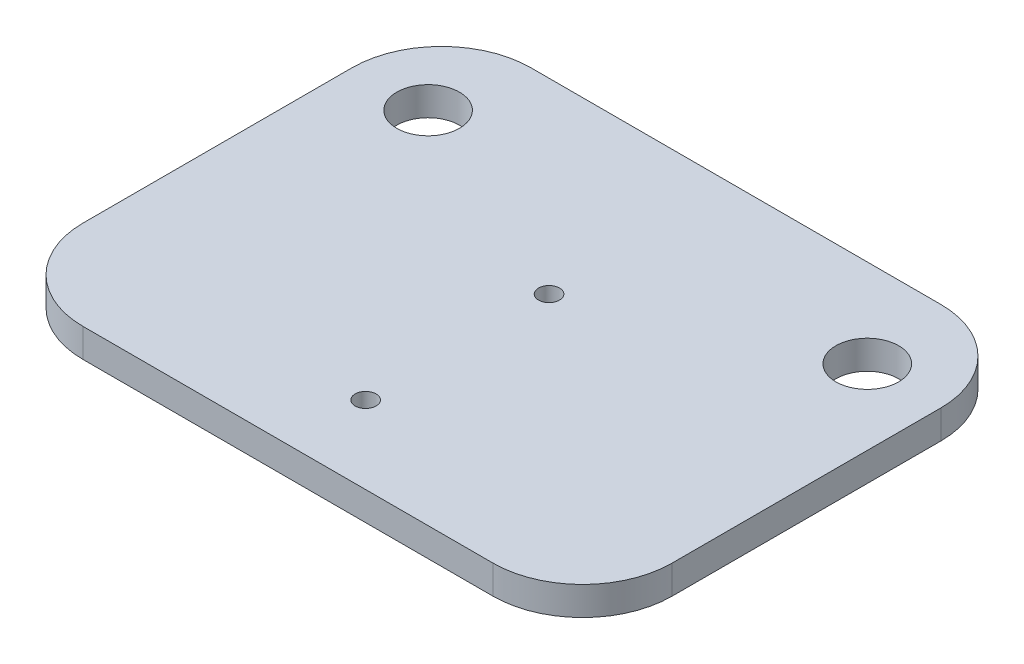
ISO-10303-21;
HEADER;
FILE_DESCRIPTION(('STEP AP214'),'2;1');
FILE_NAME('part.step','',(''),(''),'','','');
FILE_SCHEMA(('AUTOMOTIVE_DESIGN { 1 0 10303 214 1 1 1 1 }'));
ENDSEC;
DATA;
#1=APPLICATION_CONTEXT('core data for automotive mechanical design processes');
#2=APPLICATION_PROTOCOL_DEFINITION('international standard','automotive_design',2000,#1);
#3=PRODUCT_CONTEXT('',#1,'mechanical');
#4=PRODUCT('Part','Part','',(#3));
#5=PRODUCT_RELATED_PRODUCT_CATEGORY('part','',(#4));
#6=PRODUCT_DEFINITION_FORMATION('','',#4);
#7=PRODUCT_DEFINITION_CONTEXT('part definition',#1,'design');
#8=PRODUCT_DEFINITION('design','',#6,#7);
#9=PRODUCT_DEFINITION_SHAPE('','',#8);
#10=(LENGTH_UNIT() NAMED_UNIT(*) SI_UNIT(.MILLI.,.METRE.));
#11=(NAMED_UNIT(*) PLANE_ANGLE_UNIT() SI_UNIT($,.RADIAN.));
#12=(NAMED_UNIT(*) SI_UNIT($,.STERADIAN.) SOLID_ANGLE_UNIT());
#13=UNCERTAINTY_MEASURE_WITH_UNIT(LENGTH_MEASURE(1.E-05),#10,'distance_accuracy_value','');
#14=(GEOMETRIC_REPRESENTATION_CONTEXT(3) GLOBAL_UNCERTAINTY_ASSIGNED_CONTEXT((#13)) GLOBAL_UNIT_ASSIGNED_CONTEXT((#10,
#11,#12)) REPRESENTATION_CONTEXT('',''));
#15=CARTESIAN_POINT('',(0.,0.,0.));
#16=DIRECTION('',(0.,0.,1.));
#17=DIRECTION('',(1.,0.,0.));
#18=AXIS2_PLACEMENT_3D('',#15,#16,#17);
#19=CARTESIAN_POINT('',(-5.81,0.8128,3.81));
#20=DIRECTION('',(0.,-1.,0.));
#21=DIRECTION('',(0.,0.,-1.));
#22=AXIS2_PLACEMENT_3D('',#19,#20,#21);
#23=CYLINDRICAL_SURFACE('',#22,2.54);
#24=CARTESIAN_POINT('',(-5.81,0.,3.81));
#25=DIRECTION('',(0.,1.,0.));
#26=DIRECTION('',(0.,0.,1.));
#27=AXIS2_PLACEMENT_3D('',#24,#25,#26);
#28=CIRCLE('',#27,2.54);
#29=CARTESIAN_POINT('',(-8.35,0.,3.80999999999998));
#30=VERTEX_POINT('',#29);
#31=CARTESIAN_POINT('',(-5.80999999999998,0.,6.35));
#32=VERTEX_POINT('',#31);
#33=EDGE_CURVE('E133',#30,#32,#28,.T.);
#34=ORIENTED_EDGE('',*,*,#33,.T.);
#35=DIRECTION('',(0.,-1.,0.));
#36=VECTOR('',#35,1.);
#37=CARTESIAN_POINT('',(-5.80999999999998,0.8128,6.35));
#38=LINE('',#37,#36);
#39=CARTESIAN_POINT('',(-5.80999999999998,0.8128,6.35));
#40=VERTEX_POINT('',#39);
#41=EDGE_CURVE('E11',#40,#32,#38,.T.);
#42=ORIENTED_EDGE('',*,*,#41,.F.);
#43=CARTESIAN_POINT('',(-5.81,0.8128,3.81));
#44=DIRECTION('',(0.,1.,0.));
#45=DIRECTION('',(0.,0.,1.));
#46=AXIS2_PLACEMENT_3D('',#43,#44,#45);
#47=CIRCLE('',#46,2.54);
#48=CARTESIAN_POINT('',(-8.35,0.8128,3.80999999999998));
#49=VERTEX_POINT('',#48);
#50=EDGE_CURVE('E148',#49,#40,#47,.T.);
#51=ORIENTED_EDGE('',*,*,#50,.F.);
#52=DIRECTION('',(0.,-1.,0.));
#53=VECTOR('',#52,1.);
#54=CARTESIAN_POINT('',(-8.35,0.8128,3.80999999999998));
#55=LINE('',#54,#53);
#56=EDGE_CURVE('E129',#49,#30,#55,.T.);
#57=ORIENTED_EDGE('',*,*,#56,.T.);
#58=EDGE_LOOP('',(#34,#42,#51,#57));
#59=FACE_BOUND('',#58,.T.);
#60=ADVANCED_FACE('F35',(#59),#23,.T.);
#61=CARTESIAN_POINT('',(-5.80999999999998,0.8128,6.35));
#62=DIRECTION('',(0.,0.,-1.));
#63=DIRECTION('',(-1.,0.,0.));
#64=AXIS2_PLACEMENT_3D('',#61,#62,#63);
#65=PLANE('',#64);
#66=DIRECTION('',(1.,0.,0.));
#67=VECTOR('',#66,1.);
#68=CARTESIAN_POINT('',(-5.80999999999998,0.,6.35));
#69=LINE('',#68,#67);
#70=CARTESIAN_POINT('',(5.80999999999998,0.,6.35));
#71=VERTEX_POINT('',#70);
#72=EDGE_CURVE('E136',#32,#71,#69,.T.);
#73=ORIENTED_EDGE('',*,*,#72,.T.);
#74=DIRECTION('',(0.,-1.,0.));
#75=VECTOR('',#74,1.);
#76=CARTESIAN_POINT('',(5.80999999999998,0.8128,6.35));
#77=LINE('',#76,#75);
#78=CARTESIAN_POINT('',(5.80999999999998,0.8128,6.35));
#79=VERTEX_POINT('',#78);
#80=EDGE_CURVE('E44',#79,#71,#77,.T.);
#81=ORIENTED_EDGE('',*,*,#80,.F.);
#82=DIRECTION('',(1.,0.,0.));
#83=VECTOR('',#82,1.);
#84=CARTESIAN_POINT('',(-5.80999999999998,0.8128,6.35));
#85=LINE('',#84,#83);
#86=EDGE_CURVE('E96',#40,#79,#85,.T.);
#87=ORIENTED_EDGE('',*,*,#86,.F.);
#88=ORIENTED_EDGE('',*,*,#41,.T.);
#89=EDGE_LOOP('',(#73,#81,#87,#88));
#90=FACE_BOUND('',#89,.T.);
#91=ADVANCED_FACE('F216',(#90),#65,.F.);
#92=CARTESIAN_POINT('',(5.81,0.8128,3.81));
#93=DIRECTION('',(0.,-1.,0.));
#94=DIRECTION('',(0.,0.,-1.));
#95=AXIS2_PLACEMENT_3D('',#92,#93,#94);
#96=CYLINDRICAL_SURFACE('',#95,2.54);
#97=CARTESIAN_POINT('',(5.81,0.,3.81));
#98=DIRECTION('',(0.,1.,0.));
#99=DIRECTION('',(0.,0.,1.));
#100=AXIS2_PLACEMENT_3D('',#97,#98,#99);
#101=CIRCLE('',#100,2.54);
#102=CARTESIAN_POINT('',(8.35,0.,3.80999999999998));
#103=VERTEX_POINT('',#102);
#104=EDGE_CURVE('E139',#71,#103,#101,.T.);
#105=ORIENTED_EDGE('',*,*,#104,.T.);
#106=DIRECTION('',(0.,-1.,0.));
#107=VECTOR('',#106,1.);
#108=CARTESIAN_POINT('',(8.35,0.8128,3.80999999999998));
#109=LINE('',#108,#107);
#110=CARTESIAN_POINT('',(8.35,0.8128,3.80999999999998));
#111=VERTEX_POINT('',#110);
#112=EDGE_CURVE('E155',#111,#103,#109,.T.);
#113=ORIENTED_EDGE('',*,*,#112,.F.);
#114=CARTESIAN_POINT('',(5.81,0.8128,3.81));
#115=DIRECTION('',(0.,1.,0.));
#116=DIRECTION('',(0.,0.,1.));
#117=AXIS2_PLACEMENT_3D('',#114,#115,#116);
#118=CIRCLE('',#117,2.54);
#119=EDGE_CURVE('E184',#79,#111,#118,.T.);
#120=ORIENTED_EDGE('',*,*,#119,.F.);
#121=ORIENTED_EDGE('',*,*,#80,.T.);
#122=EDGE_LOOP('',(#105,#113,#120,#121));
#123=FACE_BOUND('',#122,.T.);
#124=ADVANCED_FACE('F220',(#123),#96,.T.);
#125=CARTESIAN_POINT('',(8.35,0.8128,3.80999999999998));
#126=DIRECTION('',(-1.,0.,0.));
#127=DIRECTION('',(0.,0.,1.));
#128=AXIS2_PLACEMENT_3D('',#125,#126,#127);
#129=PLANE('',#128);
#130=DIRECTION('',(0.,0.,-1.));
#131=VECTOR('',#130,1.);
#132=CARTESIAN_POINT('',(8.35,0.,3.80999999999998));
#133=LINE('',#132,#131);
#134=CARTESIAN_POINT('',(8.35,0.,-3.80999999999998));
#135=VERTEX_POINT('',#134);
#136=EDGE_CURVE('E141',#103,#135,#133,.T.);
#137=ORIENTED_EDGE('',*,*,#136,.T.);
#138=DIRECTION('',(0.,-1.,0.));
#139=VECTOR('',#138,1.);
#140=CARTESIAN_POINT('',(8.35,0.8128,-3.80999999999998));
#141=LINE('',#140,#139);
#142=CARTESIAN_POINT('',(8.35,0.8128,-3.80999999999998));
#143=VERTEX_POINT('',#142);
#144=EDGE_CURVE('E152',#143,#135,#141,.T.);
#145=ORIENTED_EDGE('',*,*,#144,.F.);
#146=DIRECTION('',(0.,0.,-1.));
#147=VECTOR('',#146,1.);
#148=CARTESIAN_POINT('',(8.35,0.8128,3.80999999999998));
#149=LINE('',#148,#147);
#150=EDGE_CURVE('E186',#111,#143,#149,.T.);
#151=ORIENTED_EDGE('',*,*,#150,.F.);
#152=ORIENTED_EDGE('',*,*,#112,.T.);
#153=EDGE_LOOP('',(#137,#145,#151,#152));
#154=FACE_BOUND('',#153,.T.);
#155=ADVANCED_FACE('F192',(#154),#129,.F.);
#156=CARTESIAN_POINT('',(5.81,0.8128,-3.81));
#157=DIRECTION('',(0.,-1.,0.));
#158=DIRECTION('',(0.,0.,-1.));
#159=AXIS2_PLACEMENT_3D('',#156,#157,#158);
#160=CYLINDRICAL_SURFACE('',#159,2.54);
#161=CARTESIAN_POINT('',(5.81,0.,-3.81));
#162=DIRECTION('',(0.,1.,0.));
#163=DIRECTION('',(0.,0.,1.));
#164=AXIS2_PLACEMENT_3D('',#161,#162,#163);
#165=CIRCLE('',#164,2.54);
#166=CARTESIAN_POINT('',(5.80999999999998,0.,-6.35));
#167=VERTEX_POINT('',#166);
#168=EDGE_CURVE('E143',#135,#167,#165,.T.);
#169=ORIENTED_EDGE('',*,*,#168,.T.);
#170=DIRECTION('',(0.,-1.,0.));
#171=VECTOR('',#170,1.);
#172=CARTESIAN_POINT('',(5.80999999999998,0.8128,-6.35));
#173=LINE('',#172,#171);
#174=CARTESIAN_POINT('',(5.80999999999998,0.8128,-6.35));
#175=VERTEX_POINT('',#174);
#176=EDGE_CURVE('E124',#175,#167,#173,.T.);
#177=ORIENTED_EDGE('',*,*,#176,.F.);
#178=CARTESIAN_POINT('',(5.81,0.8128,-3.81));
#179=DIRECTION('',(0.,1.,0.));
#180=DIRECTION('',(0.,0.,1.));
#181=AXIS2_PLACEMENT_3D('',#178,#179,#180);
#182=CIRCLE('',#181,2.54);
#183=EDGE_CURVE('E115',#143,#175,#182,.T.);
#184=ORIENTED_EDGE('',*,*,#183,.F.);
#185=ORIENTED_EDGE('',*,*,#144,.T.);
#186=EDGE_LOOP('',(#169,#177,#184,#185));
#187=FACE_BOUND('',#186,.T.);
#188=ADVANCED_FACE('F196',(#187),#160,.T.);
#189=CARTESIAN_POINT('',(-5.80999999999998,0.8128,-6.35));
#190=DIRECTION('',(0.,0.,1.));
#191=DIRECTION('',(1.,0.,0.));
#192=AXIS2_PLACEMENT_3D('',#189,#190,#191);
#193=PLANE('',#192);
#194=DIRECTION('',(-1.,0.,0.));
#195=VECTOR('',#194,1.);
#196=CARTESIAN_POINT('',(-5.80999999999998,0.,-6.35));
#197=LINE('',#196,#195);
#198=CARTESIAN_POINT('',(-5.80999999999998,0.,-6.35));
#199=VERTEX_POINT('',#198);
#200=EDGE_CURVE('E123',#167,#199,#197,.T.);
#201=ORIENTED_EDGE('',*,*,#200,.T.);
#202=DIRECTION('',(0.,-1.,0.));
#203=VECTOR('',#202,1.);
#204=CARTESIAN_POINT('',(-5.80999999999998,0.8128,-6.35));
#205=LINE('',#204,#203);
#206=CARTESIAN_POINT('',(-5.80999999999998,0.8128,-6.35));
#207=VERTEX_POINT('',#206);
#208=EDGE_CURVE('E120',#207,#199,#205,.T.);
#209=ORIENTED_EDGE('',*,*,#208,.F.);
#210=DIRECTION('',(-1.,0.,0.));
#211=VECTOR('',#210,1.);
#212=CARTESIAN_POINT('',(-5.80999999999998,0.8128,-6.35));
#213=LINE('',#212,#211);
#214=EDGE_CURVE('E109',#175,#207,#213,.T.);
#215=ORIENTED_EDGE('',*,*,#214,.F.);
#216=ORIENTED_EDGE('',*,*,#176,.T.);
#217=EDGE_LOOP('',(#201,#209,#215,#216));
#218=FACE_BOUND('',#217,.T.);
#219=ADVANCED_FACE('F121',(#218),#193,.F.);
#220=CARTESIAN_POINT('',(-5.81,0.8128,-3.81));
#221=DIRECTION('',(0.,-1.,0.));
#222=DIRECTION('',(0.,0.,-1.));
#223=AXIS2_PLACEMENT_3D('',#220,#221,#222);
#224=CYLINDRICAL_SURFACE('',#223,2.54);
#225=CARTESIAN_POINT('',(-5.81,0.,-3.81));
#226=DIRECTION('',(0.,1.,0.));
#227=DIRECTION('',(0.,0.,1.));
#228=AXIS2_PLACEMENT_3D('',#225,#226,#227);
#229=CIRCLE('',#228,2.54);
#230=CARTESIAN_POINT('',(-8.35,0.,-3.80999999999998));
#231=VERTEX_POINT('',#230);
#232=EDGE_CURVE('E82',#199,#231,#229,.T.);
#233=ORIENTED_EDGE('',*,*,#232,.T.);
#234=DIRECTION('',(0.,-1.,0.));
#235=VECTOR('',#234,1.);
#236=CARTESIAN_POINT('',(-8.35,0.8128,-3.80999999999998));
#237=LINE('',#236,#235);
#238=CARTESIAN_POINT('',(-8.35,0.8128,-3.80999999999998));
#239=VERTEX_POINT('',#238);
#240=EDGE_CURVE('E125',#239,#231,#237,.T.);
#241=ORIENTED_EDGE('',*,*,#240,.F.);
#242=CARTESIAN_POINT('',(-5.81,0.8128,-3.81));
#243=DIRECTION('',(0.,1.,0.));
#244=DIRECTION('',(0.,0.,1.));
#245=AXIS2_PLACEMENT_3D('',#242,#243,#244);
#246=CIRCLE('',#245,2.54);
#247=EDGE_CURVE('E113',#207,#239,#246,.T.);
#248=ORIENTED_EDGE('',*,*,#247,.F.);
#249=ORIENTED_EDGE('',*,*,#208,.T.);
#250=EDGE_LOOP('',(#233,#241,#248,#249));
#251=FACE_BOUND('',#250,.T.);
#252=ADVANCED_FACE('F127',(#251),#224,.T.);
#253=CARTESIAN_POINT('',(-8.35,0.8128,3.80999999999998));
#254=DIRECTION('',(1.,0.,0.));
#255=DIRECTION('',(0.,0.,-1.));
#256=AXIS2_PLACEMENT_3D('',#253,#254,#255);
#257=PLANE('',#256);
#258=DIRECTION('',(0.,0.,1.));
#259=VECTOR('',#258,1.);
#260=CARTESIAN_POINT('',(-8.35,0.,3.80999999999998));
#261=LINE('',#260,#259);
#262=EDGE_CURVE('E88',#231,#30,#261,.T.);
#263=ORIENTED_EDGE('',*,*,#262,.T.);
#264=ORIENTED_EDGE('',*,*,#56,.F.);
#265=DIRECTION('',(0.,0.,1.));
#266=VECTOR('',#265,1.);
#267=CARTESIAN_POINT('',(-8.35,0.8128,3.80999999999998));
#268=LINE('',#267,#266);
#269=EDGE_CURVE('E53',#239,#49,#268,.T.);
#270=ORIENTED_EDGE('',*,*,#269,.F.);
#271=ORIENTED_EDGE('',*,*,#240,.T.);
#272=EDGE_LOOP('',(#263,#264,#270,#271));
#273=FACE_BOUND('',#272,.T.);
#274=ADVANCED_FACE('F204',(#273),#257,.F.);
#275=CARTESIAN_POINT('',(-5.81,0.8128,3.81));
#276=DIRECTION('',(0.,1.,0.));
#277=DIRECTION('',(0.,0.,1.));
#278=AXIS2_PLACEMENT_3D('',#275,#276,#277);
#279=PLANE('',#278);
#280=CARTESIAN_POINT('',(-6.22836359994347,0.8128,-3.85));
#281=DIRECTION('',(0.,1.,0.));
#282=DIRECTION('',(0.,0.,1.));
#283=AXIS2_PLACEMENT_3D('',#280,#281,#282);
#284=CIRCLE('',#283,0.889);
#285=CARTESIAN_POINT('',(-6.22836359994347,0.8128,-2.961));
#286=VERTEX_POINT('',#285);
#287=EDGE_CURVE('E137',#286,#286,#284,.T.);
#288=ORIENTED_EDGE('',*,*,#287,.F.);
#289=EDGE_LOOP('',(#288));
#290=FACE_BOUND('',#289,.T.);
#291=CARTESIAN_POINT('',(0.,0.8128,-1.05));
#292=DIRECTION('',(0.,1.,0.));
#293=DIRECTION('',(0.,0.,1.));
#294=AXIS2_PLACEMENT_3D('',#291,#292,#293);
#295=CIRCLE('',#294,0.297244980669235);
#296=CARTESIAN_POINT('',(0.,0.8128,-0.752755019330762));
#297=VERTEX_POINT('',#296);
#298=EDGE_CURVE('E169',#297,#297,#295,.T.);
#299=ORIENTED_EDGE('',*,*,#298,.F.);
#300=EDGE_LOOP('',(#299));
#301=FACE_BOUND('',#300,.T.);
#302=CARTESIAN_POINT('',(0.,0.8128,4.15));
#303=DIRECTION('',(0.,1.,0.));
#304=DIRECTION('',(0.,0.,1.));
#305=AXIS2_PLACEMENT_3D('',#302,#303,#304);
#306=CIRCLE('',#305,0.297244980669235);
#307=CARTESIAN_POINT('',(0.,0.8128,4.44724498066924));
#308=VERTEX_POINT('',#307);
#309=EDGE_CURVE('E166',#308,#308,#306,.T.);
#310=ORIENTED_EDGE('',*,*,#309,.F.);
#311=EDGE_LOOP('',(#310));
#312=FACE_BOUND('',#311,.T.);
#313=CARTESIAN_POINT('',(6.223,0.8128,-3.85));
#314=DIRECTION('',(0.,1.,0.));
#315=DIRECTION('',(0.,0.,1.));
#316=AXIS2_PLACEMENT_3D('',#313,#314,#315);
#317=CIRCLE('',#316,0.889);
#318=CARTESIAN_POINT('',(6.223,0.8128,-2.961));
#319=VERTEX_POINT('',#318);
#320=EDGE_CURVE('E163',#319,#319,#317,.T.);
#321=ORIENTED_EDGE('',*,*,#320,.F.);
#322=EDGE_LOOP('',(#321));
#323=FACE_BOUND('',#322,.T.);
#324=ORIENTED_EDGE('',*,*,#50,.T.);
#325=ORIENTED_EDGE('',*,*,#86,.T.);
#326=ORIENTED_EDGE('',*,*,#119,.T.);
#327=ORIENTED_EDGE('',*,*,#150,.T.);
#328=ORIENTED_EDGE('',*,*,#183,.T.);
#329=ORIENTED_EDGE('',*,*,#214,.T.);
#330=ORIENTED_EDGE('',*,*,#247,.T.);
#331=ORIENTED_EDGE('',*,*,#269,.T.);
#332=EDGE_LOOP('',(#324,#325,#326,#327,#328,#329,#330,#331));
#333=FACE_BOUND('',#332,.T.);
#334=ADVANCED_FACE('F111',(#290,#301,#312,#323,#333),#279,.T.);
#335=CARTESIAN_POINT('',(-5.81,0.,3.81));
#336=DIRECTION('',(0.,1.,0.));
#337=DIRECTION('',(0.,0.,1.));
#338=AXIS2_PLACEMENT_3D('',#335,#336,#337);
#339=PLANE('',#338);
#340=CARTESIAN_POINT('',(-6.22836359994347,0.,-3.85));
#341=DIRECTION('',(0.,1.,0.));
#342=DIRECTION('',(0.,0.,1.));
#343=AXIS2_PLACEMENT_3D('',#340,#341,#342);
#344=CIRCLE('',#343,0.889);
#345=CARTESIAN_POINT('',(-6.22836359994347,0.,-2.961));
#346=VERTEX_POINT('',#345);
#347=EDGE_CURVE('E38',#346,#346,#344,.T.);
#348=ORIENTED_EDGE('',*,*,#347,.T.);
#349=EDGE_LOOP('',(#348));
#350=FACE_BOUND('',#349,.T.);
#351=CARTESIAN_POINT('',(0.,0.,-1.05));
#352=DIRECTION('',(0.,1.,0.));
#353=DIRECTION('',(0.,0.,1.));
#354=AXIS2_PLACEMENT_3D('',#351,#352,#353);
#355=CIRCLE('',#354,0.297244980669235);
#356=CARTESIAN_POINT('',(0.,0.,-0.752755019330762));
#357=VERTEX_POINT('',#356);
#358=EDGE_CURVE('E167',#357,#357,#355,.T.);
#359=ORIENTED_EDGE('',*,*,#358,.T.);
#360=EDGE_LOOP('',(#359));
#361=FACE_BOUND('',#360,.T.);
#362=CARTESIAN_POINT('',(0.,0.,4.15));
#363=DIRECTION('',(0.,1.,0.));
#364=DIRECTION('',(0.,0.,1.));
#365=AXIS2_PLACEMENT_3D('',#362,#363,#364);
#366=CIRCLE('',#365,0.297244980669235);
#367=CARTESIAN_POINT('',(0.,0.,4.44724498066924));
#368=VERTEX_POINT('',#367);
#369=EDGE_CURVE('E164',#368,#368,#366,.T.);
#370=ORIENTED_EDGE('',*,*,#369,.T.);
#371=EDGE_LOOP('',(#370));
#372=FACE_BOUND('',#371,.T.);
#373=CARTESIAN_POINT('',(6.223,0.,-3.85));
#374=DIRECTION('',(0.,1.,0.));
#375=DIRECTION('',(0.,0.,1.));
#376=AXIS2_PLACEMENT_3D('',#373,#374,#375);
#377=CIRCLE('',#376,0.889);
#378=CARTESIAN_POINT('',(6.223,0.,-2.961));
#379=VERTEX_POINT('',#378);
#380=EDGE_CURVE('E160',#379,#379,#377,.T.);
#381=ORIENTED_EDGE('',*,*,#380,.T.);
#382=EDGE_LOOP('',(#381));
#383=FACE_BOUND('',#382,.T.);
#384=ORIENTED_EDGE('',*,*,#33,.F.);
#385=ORIENTED_EDGE('',*,*,#262,.F.);
#386=ORIENTED_EDGE('',*,*,#232,.F.);
#387=ORIENTED_EDGE('',*,*,#200,.F.);
#388=ORIENTED_EDGE('',*,*,#168,.F.);
#389=ORIENTED_EDGE('',*,*,#136,.F.);
#390=ORIENTED_EDGE('',*,*,#104,.F.);
#391=ORIENTED_EDGE('',*,*,#72,.F.);
#392=EDGE_LOOP('',(#384,#385,#386,#387,#388,#389,#390,#391));
#393=FACE_BOUND('',#392,.T.);
#394=ADVANCED_FACE('F199',(#350,#361,#372,#383,#393),#339,.F.);
#395=CARTESIAN_POINT('',(6.223,-5.8928,-3.85));
#396=DIRECTION('',(0.,1.,0.));
#397=DIRECTION('',(0.,0.,1.));
#398=AXIS2_PLACEMENT_3D('',#395,#396,#397);
#399=CYLINDRICAL_SURFACE('',#398,0.889);
#400=ORIENTED_EDGE('',*,*,#320,.T.);
#401=EDGE_LOOP('',(#400));
#402=FACE_BOUND('',#401,.T.);
#403=ORIENTED_EDGE('',*,*,#380,.F.);
#404=EDGE_LOOP('',(#403));
#405=FACE_BOUND('',#404,.T.);
#406=ADVANCED_FACE('F259',(#402,#405),#399,.F.);
#407=CARTESIAN_POINT('',(0.,-5.8928,4.15));
#408=DIRECTION('',(0.,1.,0.));
#409=DIRECTION('',(0.,0.,1.));
#410=AXIS2_PLACEMENT_3D('',#407,#408,#409);
#411=CYLINDRICAL_SURFACE('',#410,0.297244980669235);
#412=ORIENTED_EDGE('',*,*,#309,.T.);
#413=EDGE_LOOP('',(#412));
#414=FACE_BOUND('',#413,.T.);
#415=ORIENTED_EDGE('',*,*,#369,.F.);
#416=EDGE_LOOP('',(#415));
#417=FACE_BOUND('',#416,.T.);
#418=ADVANCED_FACE('F268',(#414,#417),#411,.F.);
#419=CARTESIAN_POINT('',(0.,-5.8928,-1.05));
#420=DIRECTION('',(0.,1.,0.));
#421=DIRECTION('',(0.,0.,1.));
#422=AXIS2_PLACEMENT_3D('',#419,#420,#421);
#423=CYLINDRICAL_SURFACE('',#422,0.297244980669235);
#424=ORIENTED_EDGE('',*,*,#298,.T.);
#425=EDGE_LOOP('',(#424));
#426=FACE_BOUND('',#425,.T.);
#427=ORIENTED_EDGE('',*,*,#358,.F.);
#428=EDGE_LOOP('',(#427));
#429=FACE_BOUND('',#428,.T.);
#430=ADVANCED_FACE('F278',(#426,#429),#423,.F.);
#431=CARTESIAN_POINT('',(-6.22836359994347,-5.8928,-3.85));
#432=DIRECTION('',(0.,1.,0.));
#433=DIRECTION('',(0.,0.,1.));
#434=AXIS2_PLACEMENT_3D('',#431,#432,#433);
#435=CYLINDRICAL_SURFACE('',#434,0.889);
#436=ORIENTED_EDGE('',*,*,#287,.T.);
#437=EDGE_LOOP('',(#436));
#438=FACE_BOUND('',#437,.T.);
#439=ORIENTED_EDGE('',*,*,#347,.F.);
#440=EDGE_LOOP('',(#439));
#441=FACE_BOUND('',#440,.T.);
#442=ADVANCED_FACE('F287',(#438,#441),#435,.F.);
#443=CLOSED_SHELL('',(#60,#91,#124,#155,#188,#219,#252,#274,#334,#394,#406,#418,#430,#442));
#444=MANIFOLD_SOLID_BREP('B2',#443);
#445=ADVANCED_BREP_SHAPE_REPRESENTATION('',(#18,#444),#14);
#446=SHAPE_DEFINITION_REPRESENTATION(#9,#445);
ENDSEC;
END-ISO-10303-21;
